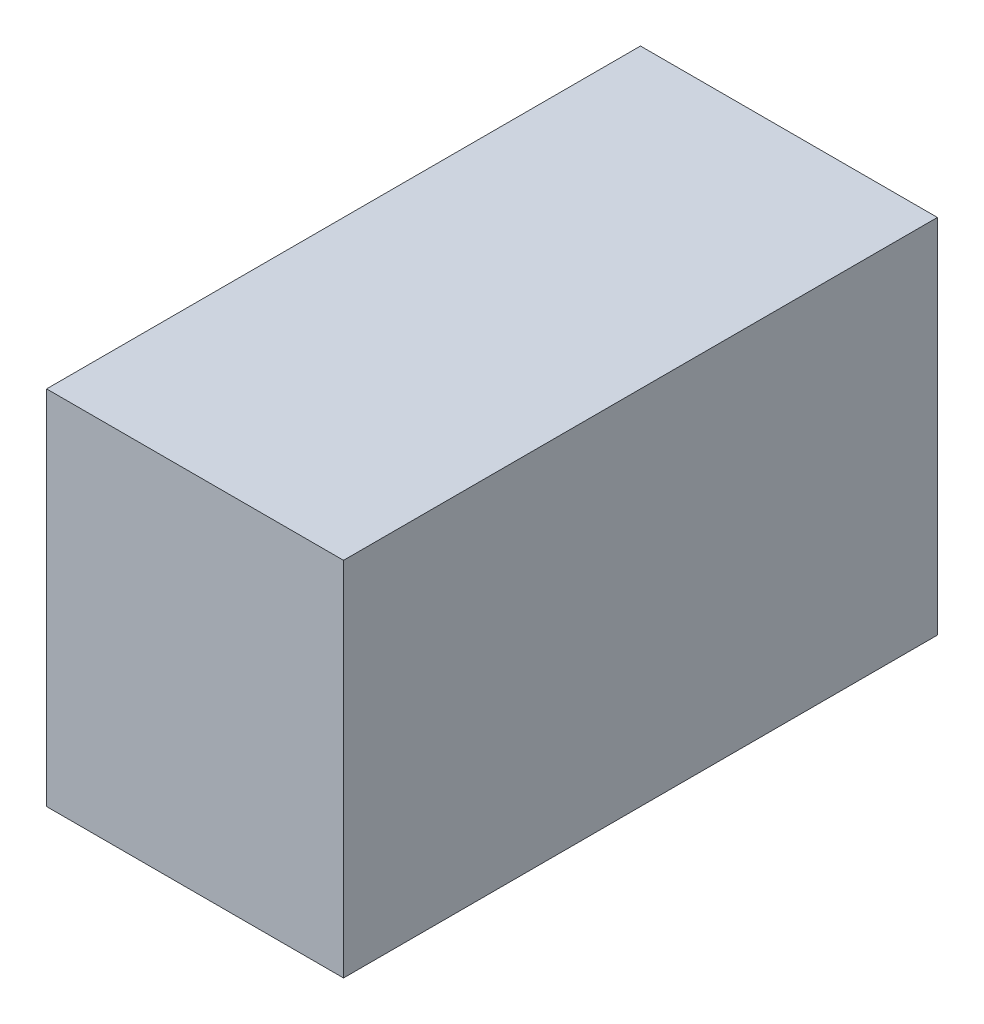
ISO-10303-21;
HEADER;
FILE_DESCRIPTION(('STEP AP214'),'2;1');
FILE_NAME('part.step','',(''),(''),'','','');
FILE_SCHEMA(('AUTOMOTIVE_DESIGN { 1 0 10303 214 1 1 1 1 }'));
ENDSEC;
DATA;
#1=APPLICATION_CONTEXT('core data for automotive mechanical design processes');
#2=APPLICATION_PROTOCOL_DEFINITION('international standard','automotive_design',2000,#1);
#3=PRODUCT_CONTEXT('',#1,'mechanical');
#4=PRODUCT('Part','Part','',(#3));
#5=PRODUCT_RELATED_PRODUCT_CATEGORY('part','',(#4));
#6=PRODUCT_DEFINITION_FORMATION('','',#4);
#7=PRODUCT_DEFINITION_CONTEXT('part definition',#1,'design');
#8=PRODUCT_DEFINITION('design','',#6,#7);
#9=PRODUCT_DEFINITION_SHAPE('','',#8);
#10=(LENGTH_UNIT() NAMED_UNIT(*) SI_UNIT(.MILLI.,.METRE.));
#11=(NAMED_UNIT(*) PLANE_ANGLE_UNIT() SI_UNIT($,.RADIAN.));
#12=(NAMED_UNIT(*) SI_UNIT($,.STERADIAN.) SOLID_ANGLE_UNIT());
#13=UNCERTAINTY_MEASURE_WITH_UNIT(LENGTH_MEASURE(1.E-05),#10,'distance_accuracy_value','');
#14=(GEOMETRIC_REPRESENTATION_CONTEXT(3) GLOBAL_UNCERTAINTY_ASSIGNED_CONTEXT((#13)) GLOBAL_UNIT_ASSIGNED_CONTEXT((#10,
#11,#12)) REPRESENTATION_CONTEXT('',''));
#15=CARTESIAN_POINT('',(0.,0.,0.));
#16=DIRECTION('',(0.,0.,1.));
#17=DIRECTION('',(1.,0.,0.));
#18=AXIS2_PLACEMENT_3D('',#15,#16,#17);
#19=CARTESIAN_POINT('',(-27.5,33.5,55.));
#20=DIRECTION('',(1.,0.,0.));
#21=DIRECTION('',(0.,1.,0.));
#22=AXIS2_PLACEMENT_3D('',#19,#20,#21);
#23=PLANE('',#22);
#24=DIRECTION('',(0.,-1.,0.));
#25=VECTOR('',#24,1.);
#26=CARTESIAN_POINT('',(-27.5,33.5,-55.));
#27=LINE('',#26,#25);
#28=CARTESIAN_POINT('',(-27.5,33.5,-55.));
#29=VERTEX_POINT('',#28);
#30=CARTESIAN_POINT('',(-27.5,-33.5,-55.));
#31=VERTEX_POINT('',#30);
#32=EDGE_CURVE('E96',#29,#31,#27,.T.);
#33=ORIENTED_EDGE('',*,*,#32,.T.);
#34=DIRECTION('',(0.,0.,-1.));
#35=VECTOR('',#34,1.);
#36=CARTESIAN_POINT('',(-27.5,-33.5,55.));
#37=LINE('',#36,#35);
#38=CARTESIAN_POINT('',(-27.5,-33.5,55.));
#39=VERTEX_POINT('',#38);
#40=EDGE_CURVE('E11',#39,#31,#37,.T.);
#41=ORIENTED_EDGE('',*,*,#40,.F.);
#42=DIRECTION('',(0.,-1.,0.));
#43=VECTOR('',#42,1.);
#44=CARTESIAN_POINT('',(-27.5,33.5,55.));
#45=LINE('',#44,#43);
#46=CARTESIAN_POINT('',(-27.5,33.5,55.));
#47=VERTEX_POINT('',#46);
#48=EDGE_CURVE('E84',#47,#39,#45,.T.);
#49=ORIENTED_EDGE('',*,*,#48,.F.);
#50=DIRECTION('',(0.,0.,-1.));
#51=VECTOR('',#50,1.);
#52=CARTESIAN_POINT('',(-27.5,33.5,55.));
#53=LINE('',#52,#51);
#54=EDGE_CURVE('E92',#47,#29,#53,.T.);
#55=ORIENTED_EDGE('',*,*,#54,.T.);
#56=EDGE_LOOP('',(#33,#41,#49,#55));
#57=FACE_BOUND('',#56,.T.);
#58=ADVANCED_FACE('F33',(#57),#23,.F.);
#59=CARTESIAN_POINT('',(27.5,-33.5,55.));
#60=DIRECTION('',(0.,1.,0.));
#61=DIRECTION('',(-1.,0.,0.));
#62=AXIS2_PLACEMENT_3D('',#59,#60,#61);
#63=PLANE('',#62);
#64=DIRECTION('',(1.,0.,0.));
#65=VECTOR('',#64,1.);
#66=CARTESIAN_POINT('',(27.5,-33.5,-55.));
#67=LINE('',#66,#65);
#68=CARTESIAN_POINT('',(27.5,-33.5,-55.));
#69=VERTEX_POINT('',#68);
#70=EDGE_CURVE('E88',#31,#69,#67,.T.);
#71=ORIENTED_EDGE('',*,*,#70,.T.);
#72=DIRECTION('',(0.,0.,-1.));
#73=VECTOR('',#72,1.);
#74=CARTESIAN_POINT('',(27.5,-33.5,55.));
#75=LINE('',#74,#73);
#76=CARTESIAN_POINT('',(27.5,-33.5,55.));
#77=VERTEX_POINT('',#76);
#78=EDGE_CURVE('E41',#77,#69,#75,.T.);
#79=ORIENTED_EDGE('',*,*,#78,.F.);
#80=DIRECTION('',(1.,0.,0.));
#81=VECTOR('',#80,1.);
#82=CARTESIAN_POINT('',(27.5,-33.5,55.));
#83=LINE('',#82,#81);
#84=EDGE_CURVE('E79',#39,#77,#83,.T.);
#85=ORIENTED_EDGE('',*,*,#84,.F.);
#86=ORIENTED_EDGE('',*,*,#40,.T.);
#87=EDGE_LOOP('',(#71,#79,#85,#86));
#88=FACE_BOUND('',#87,.T.);
#89=ADVANCED_FACE('F87',(#88),#63,.F.);
#90=CARTESIAN_POINT('',(27.5,33.5,55.));
#91=DIRECTION('',(-1.,0.,0.));
#92=DIRECTION('',(0.,0.,1.));
#93=AXIS2_PLACEMENT_3D('',#90,#91,#92);
#94=PLANE('',#93);
#95=DIRECTION('',(0.,1.,0.));
#96=VECTOR('',#95,1.);
#97=CARTESIAN_POINT('',(27.5,33.5,-55.));
#98=LINE('',#97,#96);
#99=CARTESIAN_POINT('',(27.5,33.5,-55.));
#100=VERTEX_POINT('',#99);
#101=EDGE_CURVE('E66',#69,#100,#98,.T.);
#102=ORIENTED_EDGE('',*,*,#101,.T.);
#103=DIRECTION('',(0.,0.,-1.));
#104=VECTOR('',#103,1.);
#105=CARTESIAN_POINT('',(27.5,33.5,55.));
#106=LINE('',#105,#104);
#107=CARTESIAN_POINT('',(27.5,33.5,55.));
#108=VERTEX_POINT('',#107);
#109=EDGE_CURVE('E89',#108,#100,#106,.T.);
#110=ORIENTED_EDGE('',*,*,#109,.F.);
#111=DIRECTION('',(0.,1.,0.));
#112=VECTOR('',#111,1.);
#113=CARTESIAN_POINT('',(27.5,33.5,55.));
#114=LINE('',#113,#112);
#115=EDGE_CURVE('E82',#77,#108,#114,.T.);
#116=ORIENTED_EDGE('',*,*,#115,.F.);
#117=ORIENTED_EDGE('',*,*,#78,.T.);
#118=EDGE_LOOP('',(#102,#110,#116,#117));
#119=FACE_BOUND('',#118,.T.);
#120=ADVANCED_FACE('F90',(#119),#94,.F.);
#121=CARTESIAN_POINT('',(27.5,33.5,55.));
#122=DIRECTION('',(0.,-1.,0.));
#123=DIRECTION('',(1.,0.,0.));
#124=AXIS2_PLACEMENT_3D('',#121,#122,#123);
#125=PLANE('',#124);
#126=DIRECTION('',(-1.,0.,0.));
#127=VECTOR('',#126,1.);
#128=CARTESIAN_POINT('',(27.5,33.5,-55.));
#129=LINE('',#128,#127);
#130=EDGE_CURVE('E72',#100,#29,#129,.T.);
#131=ORIENTED_EDGE('',*,*,#130,.T.);
#132=ORIENTED_EDGE('',*,*,#54,.F.);
#133=DIRECTION('',(-1.,0.,0.));
#134=VECTOR('',#133,1.);
#135=CARTESIAN_POINT('',(27.5,33.5,55.));
#136=LINE('',#135,#134);
#137=EDGE_CURVE('E49',#108,#47,#136,.T.);
#138=ORIENTED_EDGE('',*,*,#137,.F.);
#139=ORIENTED_EDGE('',*,*,#109,.T.);
#140=EDGE_LOOP('',(#131,#132,#138,#139));
#141=FACE_BOUND('',#140,.T.);
#142=ADVANCED_FACE('F103',(#141),#125,.F.);
#143=CARTESIAN_POINT('',(0.,0.,55.));
#144=DIRECTION('',(0.,0.,-1.));
#145=DIRECTION('',(-1.,0.,0.));
#146=AXIS2_PLACEMENT_3D('',#143,#144,#145);
#147=PLANE('',#146);
#148=ORIENTED_EDGE('',*,*,#48,.T.);
#149=ORIENTED_EDGE('',*,*,#84,.T.);
#150=ORIENTED_EDGE('',*,*,#115,.T.);
#151=ORIENTED_EDGE('',*,*,#137,.T.);
#152=EDGE_LOOP('',(#148,#149,#150,#151));
#153=FACE_BOUND('',#152,.T.);
#154=ADVANCED_FACE('F80',(#153),#147,.F.);
#155=CARTESIAN_POINT('',(0.,0.,-55.));
#156=DIRECTION('',(0.,0.,-1.));
#157=DIRECTION('',(-1.,0.,0.));
#158=AXIS2_PLACEMENT_3D('',#155,#156,#157);
#159=PLANE('',#158);
#160=ORIENTED_EDGE('',*,*,#32,.F.);
#161=ORIENTED_EDGE('',*,*,#130,.F.);
#162=ORIENTED_EDGE('',*,*,#101,.F.);
#163=ORIENTED_EDGE('',*,*,#70,.F.);
#164=EDGE_LOOP('',(#160,#161,#162,#163));
#165=FACE_BOUND('',#164,.T.);
#166=ADVANCED_FACE('F106',(#165),#159,.T.);
#167=CLOSED_SHELL('',(#58,#89,#120,#142,#154,#166));
#168=MANIFOLD_SOLID_BREP('B2',#167);
#169=ADVANCED_BREP_SHAPE_REPRESENTATION('',(#18,#168),#14);
#170=SHAPE_DEFINITION_REPRESENTATION(#9,#169);
ENDSEC;
END-ISO-10303-21;
